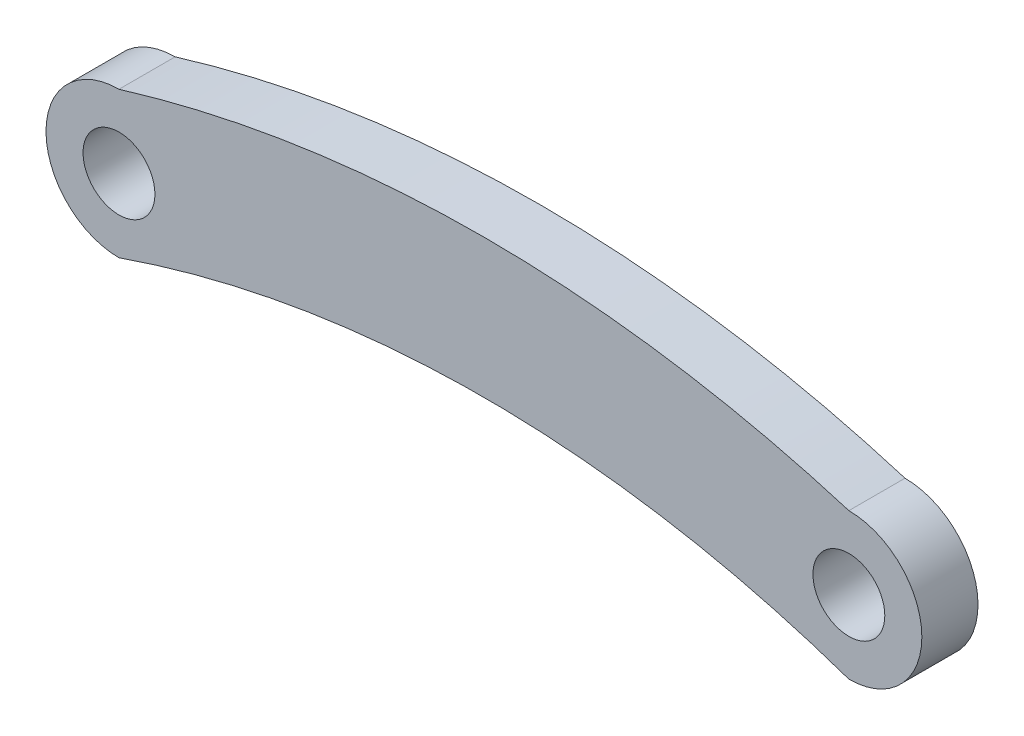
ISO-10303-21;
HEADER;
FILE_DESCRIPTION(('STEP AP214'),'2;1');
FILE_NAME('part.step','',(''),(''),'','','');
FILE_SCHEMA(('AUTOMOTIVE_DESIGN { 1 0 10303 214 1 1 1 1 }'));
ENDSEC;
DATA;
#1=APPLICATION_CONTEXT('core data for automotive mechanical design processes');
#2=APPLICATION_PROTOCOL_DEFINITION('international standard','automotive_design',2000,#1);
#3=PRODUCT_CONTEXT('',#1,'mechanical');
#4=PRODUCT('Part','Part','',(#3));
#5=PRODUCT_RELATED_PRODUCT_CATEGORY('part','',(#4));
#6=PRODUCT_DEFINITION_FORMATION('','',#4);
#7=PRODUCT_DEFINITION_CONTEXT('part definition',#1,'design');
#8=PRODUCT_DEFINITION('design','',#6,#7);
#9=PRODUCT_DEFINITION_SHAPE('','',#8);
#10=(LENGTH_UNIT() NAMED_UNIT(*) SI_UNIT(.MILLI.,.METRE.));
#11=(NAMED_UNIT(*) PLANE_ANGLE_UNIT() SI_UNIT($,.RADIAN.));
#12=(NAMED_UNIT(*) SI_UNIT($,.STERADIAN.) SOLID_ANGLE_UNIT());
#13=UNCERTAINTY_MEASURE_WITH_UNIT(LENGTH_MEASURE(1.E-05),#10,'distance_accuracy_value','');
#14=(GEOMETRIC_REPRESENTATION_CONTEXT(3) GLOBAL_UNCERTAINTY_ASSIGNED_CONTEXT((#13)) GLOBAL_UNIT_ASSIGNED_CONTEXT((#10,
#11,#12)) REPRESENTATION_CONTEXT('',''));
#15=CARTESIAN_POINT('',(0.,0.,0.));
#16=DIRECTION('',(0.,0.,1.));
#17=DIRECTION('',(1.,0.,0.));
#18=AXIS2_PLACEMENT_3D('',#15,#16,#17);
#19=CARTESIAN_POINT('',(-8.12499999999999,-25.,2.5));
#20=DIRECTION('',(0.,0.,-1.));
#21=DIRECTION('',(-1.,0.,0.));
#22=AXIS2_PLACEMENT_3D('',#19,#20,#21);
#23=PLANE('',#22);
#24=CARTESIAN_POINT('',(-16.25,-50.,2.5));
#25=DIRECTION('',(0.,0.,1.));
#26=DIRECTION('',(-1.,0.,0.));
#27=AXIS2_PLACEMENT_3D('',#24,#25,#26);
#28=CIRCLE('',#27,55.6742759270383);
#29=CARTESIAN_POINT('',(0.,3.25,2.5));
#30=VERTEX_POINT('',#29);
#31=CARTESIAN_POINT('',(-32.5,3.25,2.5));
#32=VERTEX_POINT('',#31);
#33=EDGE_CURVE('E85',#30,#32,#28,.T.);
#34=ORIENTED_EDGE('',*,*,#33,.T.);
#35=CARTESIAN_POINT('',(-32.5,0.,2.5));
#36=DIRECTION('',(0.,0.,1.));
#37=DIRECTION('',(1.,0.,0.));
#38=AXIS2_PLACEMENT_3D('',#35,#36,#37);
#39=CIRCLE('',#38,3.25);
#40=CARTESIAN_POINT('',(-32.5,-3.25,2.5));
#41=VERTEX_POINT('',#40);
#42=EDGE_CURVE('E80',#32,#41,#39,.T.);
#43=ORIENTED_EDGE('',*,*,#42,.T.);
#44=CARTESIAN_POINT('',(-16.25,-50.,2.5));
#45=DIRECTION('',(0.,0.,-1.));
#46=DIRECTION('',(-1.,0.,0.));
#47=AXIS2_PLACEMENT_3D('',#44,#45,#46);
#48=CIRCLE('',#47,49.4936864660534);
#49=CARTESIAN_POINT('',(0.,-3.25,2.5));
#50=VERTEX_POINT('',#49);
#51=EDGE_CURVE('E83',#41,#50,#48,.T.);
#52=ORIENTED_EDGE('',*,*,#51,.T.);
#53=CARTESIAN_POINT('',(0.,0.,2.5));
#54=DIRECTION('',(0.,0.,1.));
#55=DIRECTION('',(1.,0.,0.));
#56=AXIS2_PLACEMENT_3D('',#53,#54,#55);
#57=CIRCLE('',#56,3.25);
#58=EDGE_CURVE('E50',#50,#30,#57,.T.);
#59=ORIENTED_EDGE('',*,*,#58,.T.);
#60=EDGE_LOOP('',(#34,#43,#52,#59));
#61=FACE_BOUND('',#60,.T.);
#62=CARTESIAN_POINT('',(-32.5,0.,2.5));
#63=DIRECTION('',(0.,0.,1.));
#64=DIRECTION('',(1.,0.,0.));
#65=AXIS2_PLACEMENT_3D('',#62,#63,#64);
#66=CIRCLE('',#65,1.6);
#67=CARTESIAN_POINT('',(-30.9,0.,2.5));
#68=VERTEX_POINT('',#67);
#69=EDGE_CURVE('E100',#68,#68,#66,.T.);
#70=ORIENTED_EDGE('',*,*,#69,.F.);
#71=EDGE_LOOP('',(#70));
#72=FACE_BOUND('',#71,.T.);
#73=CARTESIAN_POINT('',(0.,0.,2.5));
#74=DIRECTION('',(0.,0.,1.));
#75=DIRECTION('',(1.,0.,0.));
#76=AXIS2_PLACEMENT_3D('',#73,#74,#75);
#77=CIRCLE('',#76,1.6);
#78=CARTESIAN_POINT('',(1.6,0.,2.5));
#79=VERTEX_POINT('',#78);
#80=EDGE_CURVE('E115',#79,#79,#77,.T.);
#81=ORIENTED_EDGE('',*,*,#80,.F.);
#82=EDGE_LOOP('',(#81));
#83=FACE_BOUND('',#82,.T.);
#84=ADVANCED_FACE('F33',(#61,#72,#83),#23,.F.);
#85=CARTESIAN_POINT('',(-8.12499999999999,-25.,0.));
#86=DIRECTION('',(0.,0.,-1.));
#87=DIRECTION('',(-1.,0.,0.));
#88=AXIS2_PLACEMENT_3D('',#85,#86,#87);
#89=PLANE('',#88);
#90=CARTESIAN_POINT('',(-32.5,0.,0.));
#91=DIRECTION('',(0.,0.,1.));
#92=DIRECTION('',(1.,0.,0.));
#93=AXIS2_PLACEMENT_3D('',#90,#91,#92);
#94=CIRCLE('',#93,1.6);
#95=CARTESIAN_POINT('',(-30.9,0.,0.));
#96=VERTEX_POINT('',#95);
#97=EDGE_CURVE('E112',#96,#96,#94,.T.);
#98=ORIENTED_EDGE('',*,*,#97,.T.);
#99=EDGE_LOOP('',(#98));
#100=FACE_BOUND('',#99,.T.);
#101=CARTESIAN_POINT('',(-16.25,-50.,0.));
#102=DIRECTION('',(0.,0.,1.));
#103=DIRECTION('',(-1.,0.,0.));
#104=AXIS2_PLACEMENT_3D('',#101,#102,#103);
#105=CIRCLE('',#104,55.6742759270383);
#106=CARTESIAN_POINT('',(0.,3.25,0.));
#107=VERTEX_POINT('',#106);
#108=CARTESIAN_POINT('',(-32.5,3.25,0.));
#109=VERTEX_POINT('',#108);
#110=EDGE_CURVE('E97',#107,#109,#105,.T.);
#111=ORIENTED_EDGE('',*,*,#110,.F.);
#112=CARTESIAN_POINT('',(0.,0.,0.));
#113=DIRECTION('',(0.,0.,1.));
#114=DIRECTION('',(1.,0.,0.));
#115=AXIS2_PLACEMENT_3D('',#112,#113,#114);
#116=CIRCLE('',#115,3.25);
#117=CARTESIAN_POINT('',(0.,-3.25,0.));
#118=VERTEX_POINT('',#117);
#119=EDGE_CURVE('E73',#118,#107,#116,.T.);
#120=ORIENTED_EDGE('',*,*,#119,.F.);
#121=CARTESIAN_POINT('',(-16.25,-50.,0.));
#122=DIRECTION('',(0.,0.,-1.));
#123=DIRECTION('',(-1.,0.,0.));
#124=AXIS2_PLACEMENT_3D('',#121,#122,#123);
#125=CIRCLE('',#124,49.4936864660534);
#126=CARTESIAN_POINT('',(-32.5,-3.25,0.));
#127=VERTEX_POINT('',#126);
#128=EDGE_CURVE('E67',#127,#118,#125,.T.);
#129=ORIENTED_EDGE('',*,*,#128,.F.);
#130=CARTESIAN_POINT('',(-32.5,0.,0.));
#131=DIRECTION('',(0.,0.,1.));
#132=DIRECTION('',(1.,0.,0.));
#133=AXIS2_PLACEMENT_3D('',#130,#131,#132);
#134=CIRCLE('',#133,3.25);
#135=EDGE_CURVE('E89',#109,#127,#134,.T.);
#136=ORIENTED_EDGE('',*,*,#135,.F.);
#137=EDGE_LOOP('',(#111,#120,#129,#136));
#138=FACE_BOUND('',#137,.T.);
#139=CARTESIAN_POINT('',(0.,0.,0.));
#140=DIRECTION('',(0.,0.,1.));
#141=DIRECTION('',(1.,0.,0.));
#142=AXIS2_PLACEMENT_3D('',#139,#140,#141);
#143=CIRCLE('',#142,1.6);
#144=CARTESIAN_POINT('',(1.6,0.,0.));
#145=VERTEX_POINT('',#144);
#146=EDGE_CURVE('E118',#145,#145,#143,.T.);
#147=ORIENTED_EDGE('',*,*,#146,.T.);
#148=EDGE_LOOP('',(#147));
#149=FACE_BOUND('',#148,.T.);
#150=ADVANCED_FACE('F108',(#100,#138,#149),#89,.T.);
#151=CARTESIAN_POINT('',(-16.25,-50.,2.5));
#152=DIRECTION('',(0.,0.,-1.));
#153=DIRECTION('',(-1.,0.,0.));
#154=AXIS2_PLACEMENT_3D('',#151,#152,#153);
#155=CYLINDRICAL_SURFACE('',#154,55.6742759270383);
#156=ORIENTED_EDGE('',*,*,#110,.T.);
#157=DIRECTION('',(0.,0.,-1.));
#158=VECTOR('',#157,1.);
#159=CARTESIAN_POINT('',(-32.5,3.25,2.5));
#160=LINE('',#159,#158);
#161=EDGE_CURVE('E11',#32,#109,#160,.T.);
#162=ORIENTED_EDGE('',*,*,#161,.F.);
#163=ORIENTED_EDGE('',*,*,#33,.F.);
#164=DIRECTION('',(0.,0.,-1.));
#165=VECTOR('',#164,1.);
#166=CARTESIAN_POINT('',(0.,3.25,2.5));
#167=LINE('',#166,#165);
#168=EDGE_CURVE('E93',#30,#107,#167,.T.);
#169=ORIENTED_EDGE('',*,*,#168,.T.);
#170=EDGE_LOOP('',(#156,#162,#163,#169));
#171=FACE_BOUND('',#170,.T.);
#172=ADVANCED_FACE('F35',(#171),#155,.T.);
#173=CARTESIAN_POINT('',(-32.5,0.,2.5));
#174=DIRECTION('',(0.,0.,-1.));
#175=DIRECTION('',(-1.,0.,0.));
#176=AXIS2_PLACEMENT_3D('',#173,#174,#175);
#177=CYLINDRICAL_SURFACE('',#176,3.25);
#178=ORIENTED_EDGE('',*,*,#135,.T.);
#179=DIRECTION('',(0.,0.,-1.));
#180=VECTOR('',#179,1.);
#181=CARTESIAN_POINT('',(-32.5,-3.25,2.5));
#182=LINE('',#181,#180);
#183=EDGE_CURVE('E42',#41,#127,#182,.T.);
#184=ORIENTED_EDGE('',*,*,#183,.F.);
#185=ORIENTED_EDGE('',*,*,#42,.F.);
#186=ORIENTED_EDGE('',*,*,#161,.T.);
#187=EDGE_LOOP('',(#178,#184,#185,#186));
#188=FACE_BOUND('',#187,.T.);
#189=ADVANCED_FACE('F88',(#188),#177,.T.);
#190=CARTESIAN_POINT('',(-16.25,-50.,2.5));
#191=DIRECTION('',(0.,0.,-1.));
#192=DIRECTION('',(-1.,0.,0.));
#193=AXIS2_PLACEMENT_3D('',#190,#191,#192);
#194=CYLINDRICAL_SURFACE('',#193,49.4936864660534);
#195=ORIENTED_EDGE('',*,*,#128,.T.);
#196=DIRECTION('',(0.,0.,-1.));
#197=VECTOR('',#196,1.);
#198=CARTESIAN_POINT('',(0.,-3.25,2.5));
#199=LINE('',#198,#197);
#200=EDGE_CURVE('E90',#50,#118,#199,.T.);
#201=ORIENTED_EDGE('',*,*,#200,.F.);
#202=ORIENTED_EDGE('',*,*,#51,.F.);
#203=ORIENTED_EDGE('',*,*,#183,.T.);
#204=EDGE_LOOP('',(#195,#201,#202,#203));
#205=FACE_BOUND('',#204,.T.);
#206=ADVANCED_FACE('F91',(#205),#194,.F.);
#207=CARTESIAN_POINT('',(0.,0.,2.5));
#208=DIRECTION('',(0.,0.,-1.));
#209=DIRECTION('',(-1.,0.,0.));
#210=AXIS2_PLACEMENT_3D('',#207,#208,#209);
#211=CYLINDRICAL_SURFACE('',#210,3.25);
#212=ORIENTED_EDGE('',*,*,#119,.T.);
#213=ORIENTED_EDGE('',*,*,#168,.F.);
#214=ORIENTED_EDGE('',*,*,#58,.F.);
#215=ORIENTED_EDGE('',*,*,#200,.T.);
#216=EDGE_LOOP('',(#212,#213,#214,#215));
#217=FACE_BOUND('',#216,.T.);
#218=ADVANCED_FACE('F105',(#217),#211,.T.);
#219=CARTESIAN_POINT('',(-32.5,0.,2.5));
#220=DIRECTION('',(0.,0.,-1.));
#221=DIRECTION('',(-1.,0.,0.));
#222=AXIS2_PLACEMENT_3D('',#219,#220,#221);
#223=CYLINDRICAL_SURFACE('',#222,1.6);
#224=ORIENTED_EDGE('',*,*,#69,.T.);
#225=EDGE_LOOP('',(#224));
#226=FACE_BOUND('',#225,.T.);
#227=ORIENTED_EDGE('',*,*,#97,.F.);
#228=EDGE_LOOP('',(#227));
#229=FACE_BOUND('',#228,.T.);
#230=ADVANCED_FACE('F135',(#226,#229),#223,.F.);
#231=CARTESIAN_POINT('',(0.,0.,2.5));
#232=DIRECTION('',(0.,0.,-1.));
#233=DIRECTION('',(-1.,0.,0.));
#234=AXIS2_PLACEMENT_3D('',#231,#232,#233);
#235=CYLINDRICAL_SURFACE('',#234,1.6);
#236=ORIENTED_EDGE('',*,*,#80,.T.);
#237=EDGE_LOOP('',(#236));
#238=FACE_BOUND('',#237,.T.);
#239=ORIENTED_EDGE('',*,*,#146,.F.);
#240=EDGE_LOOP('',(#239));
#241=FACE_BOUND('',#240,.T.);
#242=ADVANCED_FACE('F124',(#238,#241),#235,.F.);
#243=CLOSED_SHELL('',(#84,#150,#172,#189,#206,#218,#230,#242));
#244=MANIFOLD_SOLID_BREP('B2',#243);
#245=ADVANCED_BREP_SHAPE_REPRESENTATION('',(#18,#244),#14);
#246=SHAPE_DEFINITION_REPRESENTATION(#9,#245);
ENDSEC;
END-ISO-10303-21;
